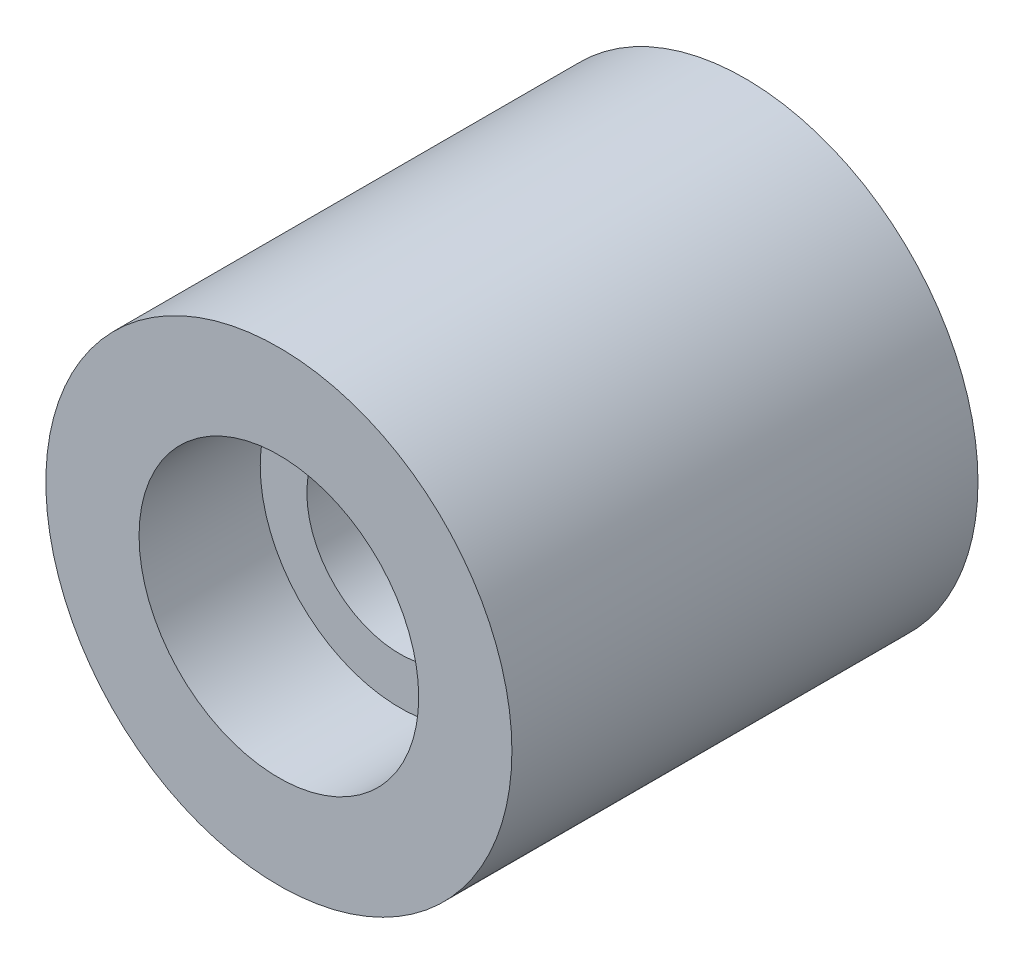
ISO-10303-21;
HEADER;
FILE_DESCRIPTION(('STEP AP214'),'2;1');
FILE_NAME('part.step','',(''),(''),'','','');
FILE_SCHEMA(('AUTOMOTIVE_DESIGN { 1 0 10303 214 1 1 1 1 }'));
ENDSEC;
DATA;
#1=APPLICATION_CONTEXT('core data for automotive mechanical design processes');
#2=APPLICATION_PROTOCOL_DEFINITION('international standard','automotive_design',2000,#1);
#3=PRODUCT_CONTEXT('',#1,'mechanical');
#4=PRODUCT('Part','Part','',(#3));
#5=PRODUCT_RELATED_PRODUCT_CATEGORY('part','',(#4));
#6=PRODUCT_DEFINITION_FORMATION('','',#4);
#7=PRODUCT_DEFINITION_CONTEXT('part definition',#1,'design');
#8=PRODUCT_DEFINITION('design','',#6,#7);
#9=PRODUCT_DEFINITION_SHAPE('','',#8);
#10=(LENGTH_UNIT() NAMED_UNIT(*) SI_UNIT(.MILLI.,.METRE.));
#11=(NAMED_UNIT(*) PLANE_ANGLE_UNIT() SI_UNIT($,.RADIAN.));
#12=(NAMED_UNIT(*) SI_UNIT($,.STERADIAN.) SOLID_ANGLE_UNIT());
#13=UNCERTAINTY_MEASURE_WITH_UNIT(LENGTH_MEASURE(1.E-05),#10,'distance_accuracy_value','');
#14=(GEOMETRIC_REPRESENTATION_CONTEXT(3) GLOBAL_UNCERTAINTY_ASSIGNED_CONTEXT((#13)) GLOBAL_UNIT_ASSIGNED_CONTEXT((#10,
#11,#12)) REPRESENTATION_CONTEXT('',''));
#15=CARTESIAN_POINT('',(0.,0.,0.));
#16=DIRECTION('',(0.,0.,1.));
#17=DIRECTION('',(1.,0.,0.));
#18=AXIS2_PLACEMENT_3D('',#15,#16,#17);
#19=CARTESIAN_POINT('',(0.,0.,0.));
#20=DIRECTION('',(0.,0.,1.));
#21=DIRECTION('',(1.,0.,0.));
#22=AXIS2_PLACEMENT_3D('',#19,#20,#21);
#23=CYLINDRICAL_SURFACE('',#22,1.5);
#24=CARTESIAN_POINT('',(0.,0.,-1.3));
#25=DIRECTION('',(0.,0.,1.));
#26=DIRECTION('',(1.,0.,0.));
#27=AXIS2_PLACEMENT_3D('',#24,#25,#26);
#28=CIRCLE('',#27,1.5);
#29=CARTESIAN_POINT('',(1.5,0.,-1.3));
#30=VERTEX_POINT('',#29);
#31=EDGE_CURVE('E69',#30,#30,#28,.T.);
#32=ORIENTED_EDGE('',*,*,#31,.F.);
#33=EDGE_LOOP('',(#32));
#34=FACE_BOUND('',#33,.T.);
#35=CARTESIAN_POINT('',(0.,0.,0.));
#36=DIRECTION('',(0.,0.,1.));
#37=DIRECTION('',(1.,0.,0.));
#38=AXIS2_PLACEMENT_3D('',#35,#36,#37);
#39=CIRCLE('',#38,1.5);
#40=CARTESIAN_POINT('',(1.5,0.,0.));
#41=VERTEX_POINT('',#40);
#42=EDGE_CURVE('E10',#41,#41,#39,.T.);
#43=ORIENTED_EDGE('',*,*,#42,.T.);
#44=EDGE_LOOP('',(#43));
#45=FACE_BOUND('',#44,.T.);
#46=ADVANCED_FACE('F35',(#34,#45),#23,.F.);
#47=CARTESIAN_POINT('',(-1.5,0.,0.));
#48=DIRECTION('',(0.,0.,-1.));
#49=DIRECTION('',(-1.,0.,0.));
#50=AXIS2_PLACEMENT_3D('',#47,#48,#49);
#51=PLANE('',#50);
#52=ORIENTED_EDGE('',*,*,#42,.F.);
#53=EDGE_LOOP('',(#52));
#54=FACE_BOUND('',#53,.T.);
#55=CARTESIAN_POINT('',(0.,0.,0.));
#56=DIRECTION('',(0.,0.,1.));
#57=DIRECTION('',(1.,0.,0.));
#58=AXIS2_PLACEMENT_3D('',#55,#56,#57);
#59=CIRCLE('',#58,2.5);
#60=CARTESIAN_POINT('',(2.5,0.,0.));
#61=VERTEX_POINT('',#60);
#62=EDGE_CURVE('E41',#61,#61,#59,.T.);
#63=ORIENTED_EDGE('',*,*,#62,.T.);
#64=EDGE_LOOP('',(#63));
#65=FACE_BOUND('',#64,.T.);
#66=ADVANCED_FACE('F76',(#54,#65),#51,.F.);
#67=CARTESIAN_POINT('',(0.,0.,0.));
#68=DIRECTION('',(0.,0.,1.));
#69=DIRECTION('',(1.,0.,0.));
#70=AXIS2_PLACEMENT_3D('',#67,#68,#69);
#71=CYLINDRICAL_SURFACE('',#70,2.5);
#72=ORIENTED_EDGE('',*,*,#62,.F.);
#73=EDGE_LOOP('',(#72));
#74=FACE_BOUND('',#73,.T.);
#75=CARTESIAN_POINT('',(0.,0.,-5.));
#76=DIRECTION('',(0.,0.,1.));
#77=DIRECTION('',(1.,0.,0.));
#78=AXIS2_PLACEMENT_3D('',#75,#76,#77);
#79=CIRCLE('',#78,2.5);
#80=CARTESIAN_POINT('',(2.5,0.,-5.));
#81=VERTEX_POINT('',#80);
#82=EDGE_CURVE('E45',#81,#81,#79,.T.);
#83=ORIENTED_EDGE('',*,*,#82,.T.);
#84=EDGE_LOOP('',(#83));
#85=FACE_BOUND('',#84,.T.);
#86=ADVANCED_FACE('F80',(#74,#85),#71,.T.);
#87=CARTESIAN_POINT('',(-2.5,0.,-5.));
#88=DIRECTION('',(0.,0.,1.));
#89=DIRECTION('',(1.,0.,0.));
#90=AXIS2_PLACEMENT_3D('',#87,#88,#89);
#91=PLANE('',#90);
#92=ORIENTED_EDGE('',*,*,#82,.F.);
#93=EDGE_LOOP('',(#92));
#94=FACE_BOUND('',#93,.T.);
#95=CARTESIAN_POINT('',(0.,0.,-5.));
#96=DIRECTION('',(0.,0.,1.));
#97=DIRECTION('',(1.,0.,0.));
#98=AXIS2_PLACEMENT_3D('',#95,#96,#97);
#99=CIRCLE('',#98,1.);
#100=CARTESIAN_POINT('',(1.,0.,-5.));
#101=VERTEX_POINT('',#100);
#102=EDGE_CURVE('E49',#101,#101,#99,.T.);
#103=ORIENTED_EDGE('',*,*,#102,.T.);
#104=EDGE_LOOP('',(#103));
#105=FACE_BOUND('',#104,.T.);
#106=ADVANCED_FACE('F85',(#94,#105),#91,.F.);
#107=CARTESIAN_POINT('',(0.,0.,0.));
#108=DIRECTION('',(0.,0.,1.));
#109=DIRECTION('',(1.,0.,0.));
#110=AXIS2_PLACEMENT_3D('',#107,#108,#109);
#111=CYLINDRICAL_SURFACE('',#110,1.);
#112=ORIENTED_EDGE('',*,*,#102,.F.);
#113=EDGE_LOOP('',(#112));
#114=FACE_BOUND('',#113,.T.);
#115=CARTESIAN_POINT('',(0.,0.,-4.5));
#116=DIRECTION('',(0.,0.,1.));
#117=DIRECTION('',(1.,0.,0.));
#118=AXIS2_PLACEMENT_3D('',#115,#116,#117);
#119=CIRCLE('',#118,1.);
#120=CARTESIAN_POINT('',(1.,0.,-4.5));
#121=VERTEX_POINT('',#120);
#122=EDGE_CURVE('E54',#121,#121,#119,.T.);
#123=ORIENTED_EDGE('',*,*,#122,.T.);
#124=EDGE_LOOP('',(#123));
#125=FACE_BOUND('',#124,.T.);
#126=ADVANCED_FACE('F91',(#114,#125),#111,.F.);
#127=CARTESIAN_POINT('',(-2.,0.,-4.5));
#128=DIRECTION('',(0.,0.,-1.));
#129=DIRECTION('',(-1.,0.,0.));
#130=AXIS2_PLACEMENT_3D('',#127,#128,#129);
#131=PLANE('',#130);
#132=ORIENTED_EDGE('',*,*,#122,.F.);
#133=EDGE_LOOP('',(#132));
#134=FACE_BOUND('',#133,.T.);
#135=CARTESIAN_POINT('',(0.,0.,-4.5));
#136=DIRECTION('',(0.,0.,1.));
#137=DIRECTION('',(1.,0.,0.));
#138=AXIS2_PLACEMENT_3D('',#135,#136,#137);
#139=CIRCLE('',#138,2.);
#140=CARTESIAN_POINT('',(2.,0.,-4.5));
#141=VERTEX_POINT('',#140);
#142=EDGE_CURVE('E57',#141,#141,#139,.T.);
#143=ORIENTED_EDGE('',*,*,#142,.T.);
#144=EDGE_LOOP('',(#143));
#145=FACE_BOUND('',#144,.T.);
#146=ADVANCED_FACE('F95',(#134,#145),#131,.F.);
#147=CARTESIAN_POINT('',(0.,0.,0.));
#148=DIRECTION('',(0.,0.,1.));
#149=DIRECTION('',(1.,0.,0.));
#150=AXIS2_PLACEMENT_3D('',#147,#148,#149);
#151=CYLINDRICAL_SURFACE('',#150,2.);
#152=ORIENTED_EDGE('',*,*,#142,.F.);
#153=EDGE_LOOP('',(#152));
#154=FACE_BOUND('',#153,.T.);
#155=CARTESIAN_POINT('',(0.,0.,-1.8));
#156=DIRECTION('',(0.,0.,1.));
#157=DIRECTION('',(1.,0.,0.));
#158=AXIS2_PLACEMENT_3D('',#155,#156,#157);
#159=CIRCLE('',#158,2.);
#160=CARTESIAN_POINT('',(2.,0.,-1.8));
#161=VERTEX_POINT('',#160);
#162=EDGE_CURVE('E60',#161,#161,#159,.T.);
#163=ORIENTED_EDGE('',*,*,#162,.T.);
#164=EDGE_LOOP('',(#163));
#165=FACE_BOUND('',#164,.T.);
#166=ADVANCED_FACE('F99',(#154,#165),#151,.F.);
#167=CARTESIAN_POINT('',(-2.,0.,-1.8));
#168=DIRECTION('',(0.,0.,1.));
#169=DIRECTION('',(1.,0.,0.));
#170=AXIS2_PLACEMENT_3D('',#167,#168,#169);
#171=PLANE('',#170);
#172=ORIENTED_EDGE('',*,*,#162,.F.);
#173=EDGE_LOOP('',(#172));
#174=FACE_BOUND('',#173,.T.);
#175=CARTESIAN_POINT('',(0.,0.,-1.8));
#176=DIRECTION('',(0.,0.,1.));
#177=DIRECTION('',(1.,0.,0.));
#178=AXIS2_PLACEMENT_3D('',#175,#176,#177);
#179=CIRCLE('',#178,1.);
#180=CARTESIAN_POINT('',(1.,0.,-1.8));
#181=VERTEX_POINT('',#180);
#182=EDGE_CURVE('E63',#181,#181,#179,.T.);
#183=ORIENTED_EDGE('',*,*,#182,.T.);
#184=EDGE_LOOP('',(#183));
#185=FACE_BOUND('',#184,.T.);
#186=ADVANCED_FACE('F103',(#174,#185),#171,.F.);
#187=CARTESIAN_POINT('',(0.,0.,0.));
#188=DIRECTION('',(0.,0.,1.));
#189=DIRECTION('',(1.,0.,0.));
#190=AXIS2_PLACEMENT_3D('',#187,#188,#189);
#191=CYLINDRICAL_SURFACE('',#190,1.);
#192=ORIENTED_EDGE('',*,*,#182,.F.);
#193=EDGE_LOOP('',(#192));
#194=FACE_BOUND('',#193,.T.);
#195=CARTESIAN_POINT('',(0.,0.,-1.3));
#196=DIRECTION('',(0.,0.,1.));
#197=DIRECTION('',(1.,0.,0.));
#198=AXIS2_PLACEMENT_3D('',#195,#196,#197);
#199=CIRCLE('',#198,1.);
#200=CARTESIAN_POINT('',(1.,0.,-1.3));
#201=VERTEX_POINT('',#200);
#202=EDGE_CURVE('E66',#201,#201,#199,.T.);
#203=ORIENTED_EDGE('',*,*,#202,.T.);
#204=EDGE_LOOP('',(#203));
#205=FACE_BOUND('',#204,.T.);
#206=ADVANCED_FACE('F107',(#194,#205),#191,.F.);
#207=CARTESIAN_POINT('',(-1.5,0.,-1.3));
#208=DIRECTION('',(0.,0.,-1.));
#209=DIRECTION('',(-1.,0.,0.));
#210=AXIS2_PLACEMENT_3D('',#207,#208,#209);
#211=PLANE('',#210);
#212=ORIENTED_EDGE('',*,*,#202,.F.);
#213=EDGE_LOOP('',(#212));
#214=FACE_BOUND('',#213,.T.);
#215=ORIENTED_EDGE('',*,*,#31,.T.);
#216=EDGE_LOOP('',(#215));
#217=FACE_BOUND('',#216,.T.);
#218=ADVANCED_FACE('F73',(#214,#217),#211,.F.);
#219=CLOSED_SHELL('',(#46,#66,#86,#106,#126,#146,#166,#186,#206,#218));
#220=MANIFOLD_SOLID_BREP('B2',#219);
#221=ADVANCED_BREP_SHAPE_REPRESENTATION('',(#18,#220),#14);
#222=SHAPE_DEFINITION_REPRESENTATION(#9,#221);
ENDSEC;
END-ISO-10303-21;
